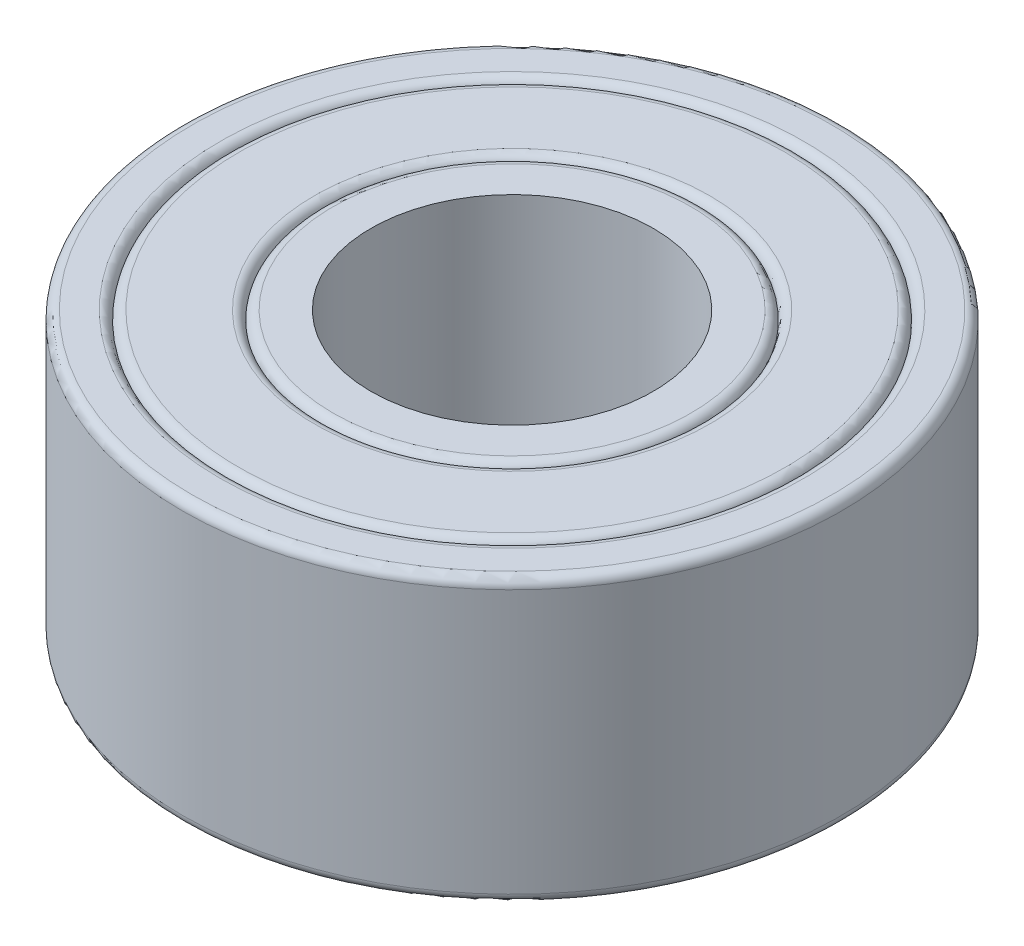
ISO-10303-21;
HEADER;
FILE_DESCRIPTION(('STEP AP214'),'2;1');
FILE_NAME('part.step','',(''),(''),'','','');
FILE_SCHEMA(('AUTOMOTIVE_DESIGN { 1 0 10303 214 1 1 1 1 }'));
ENDSEC;
DATA;
#1=APPLICATION_CONTEXT('core data for automotive mechanical design processes');
#2=APPLICATION_PROTOCOL_DEFINITION('international standard','automotive_design',2000,#1);
#3=PRODUCT_CONTEXT('',#1,'mechanical');
#4=PRODUCT('Part','Part','',(#3));
#5=PRODUCT_RELATED_PRODUCT_CATEGORY('part','',(#4));
#6=PRODUCT_DEFINITION_FORMATION('','',#4);
#7=PRODUCT_DEFINITION_CONTEXT('part definition',#1,'design');
#8=PRODUCT_DEFINITION('design','',#6,#7);
#9=PRODUCT_DEFINITION_SHAPE('','',#8);
#10=(LENGTH_UNIT() NAMED_UNIT(*) SI_UNIT(.MILLI.,.METRE.));
#11=(NAMED_UNIT(*) PLANE_ANGLE_UNIT() SI_UNIT($,.RADIAN.));
#12=(NAMED_UNIT(*) SI_UNIT($,.STERADIAN.) SOLID_ANGLE_UNIT());
#13=UNCERTAINTY_MEASURE_WITH_UNIT(LENGTH_MEASURE(1.E-05),#10,'distance_accuracy_value','');
#14=(GEOMETRIC_REPRESENTATION_CONTEXT(3) GLOBAL_UNCERTAINTY_ASSIGNED_CONTEXT((#13)) GLOBAL_UNIT_ASSIGNED_CONTEXT((#10,
#11,#12)) REPRESENTATION_CONTEXT('',''));
#15=CARTESIAN_POINT('',(0.,0.,0.));
#16=DIRECTION('',(0.,0.,1.));
#17=DIRECTION('',(1.,0.,0.));
#18=AXIS2_PLACEMENT_3D('',#15,#16,#17);
#19=CARTESIAN_POINT('',(0.,3.,0.));
#20=DIRECTION('',(0.,1.,0.));
#21=DIRECTION('',(0.,0.,1.));
#22=AXIS2_PLACEMENT_3D('',#19,#20,#21);
#23=PLANE('',#22);
#24=CARTESIAN_POINT('',(0.,3.,0.));
#25=DIRECTION('',(0.,1.,0.));
#26=DIRECTION('',(0.,0.,1.));
#27=AXIS2_PLACEMENT_3D('',#24,#25,#26);
#28=CIRCLE('',#27,1.9);
#29=CARTESIAN_POINT('',(0.,3.,1.9));
#30=VERTEX_POINT('',#29);
#31=EDGE_CURVE('E105',#30,#30,#28,.T.);
#32=ORIENTED_EDGE('',*,*,#31,.T.);
#33=EDGE_LOOP('',(#32));
#34=FACE_BOUND('',#33,.T.);
#35=CARTESIAN_POINT('',(0.,3.,0.));
#36=DIRECTION('',(0.,1.,0.));
#37=DIRECTION('',(0.,0.,1.));
#38=AXIS2_PLACEMENT_3D('',#35,#36,#37);
#39=CIRCLE('',#38,1.5);
#40=CARTESIAN_POINT('',(0.,3.,1.5));
#41=VERTEX_POINT('',#40);
#42=EDGE_CURVE('E109',#41,#41,#39,.T.);
#43=ORIENTED_EDGE('',*,*,#42,.F.);
#44=EDGE_LOOP('',(#43));
#45=FACE_BOUND('',#44,.T.);
#46=ADVANCED_FACE('F37',(#34,#45),#23,.T.);
#47=CARTESIAN_POINT('',(0.,0.,0.));
#48=DIRECTION('',(0.,1.,0.));
#49=DIRECTION('',(0.,0.,1.));
#50=AXIS2_PLACEMENT_3D('',#47,#48,#49);
#51=PLANE('',#50);
#52=CARTESIAN_POINT('',(0.,0.,0.));
#53=DIRECTION('',(0.,1.,0.));
#54=DIRECTION('',(0.,0.,1.));
#55=AXIS2_PLACEMENT_3D('',#52,#53,#54);
#56=CIRCLE('',#55,1.9);
#57=CARTESIAN_POINT('',(0.,0.,1.9));
#58=VERTEX_POINT('',#57);
#59=EDGE_CURVE('E93',#58,#58,#56,.F.);
#60=ORIENTED_EDGE('',*,*,#59,.T.);
#61=EDGE_LOOP('',(#60));
#62=FACE_BOUND('',#61,.T.);
#63=CARTESIAN_POINT('',(0.,0.,0.));
#64=DIRECTION('',(0.,1.,0.));
#65=DIRECTION('',(0.,0.,1.));
#66=AXIS2_PLACEMENT_3D('',#63,#64,#65);
#67=CIRCLE('',#66,1.5);
#68=CARTESIAN_POINT('',(0.,0.,1.5));
#69=VERTEX_POINT('',#68);
#70=EDGE_CURVE('E110',#69,#69,#67,.T.);
#71=ORIENTED_EDGE('',*,*,#70,.T.);
#72=EDGE_LOOP('',(#71));
#73=FACE_BOUND('',#72,.T.);
#74=ADVANCED_FACE('F122',(#62,#73),#51,.F.);
#75=CARTESIAN_POINT('',(0.,3.,0.));
#76=DIRECTION('',(0.,-1.,0.));
#77=DIRECTION('',(0.,0.,-1.));
#78=AXIS2_PLACEMENT_3D('',#75,#76,#77);
#79=CYLINDRICAL_SURFACE('',#78,1.5);
#80=ORIENTED_EDGE('',*,*,#42,.T.);
#81=EDGE_LOOP('',(#80));
#82=FACE_BOUND('',#81,.T.);
#83=ORIENTED_EDGE('',*,*,#70,.F.);
#84=EDGE_LOOP('',(#83));
#85=FACE_BOUND('',#84,.T.);
#86=ADVANCED_FACE('F118',(#82,#85),#79,.F.);
#87=CARTESIAN_POINT('',(0.,2.9,0.));
#88=DIRECTION('',(0.,1.,0.));
#89=DIRECTION('',(0.,0.,1.));
#90=AXIS2_PLACEMENT_3D('',#87,#88,#89);
#91=TOROIDAL_SURFACE('',#90,1.9,0.1);
#92=CARTESIAN_POINT('',(0.,2.9,0.));
#93=DIRECTION('',(0.,1.,0.));
#94=DIRECTION('',(0.,0.,1.));
#95=AXIS2_PLACEMENT_3D('',#92,#93,#94);
#96=CIRCLE('',#95,2.);
#97=CARTESIAN_POINT('',(0.,2.9,2.));
#98=VERTEX_POINT('',#97);
#99=EDGE_CURVE('E97',#98,#98,#96,.F.);
#100=ORIENTED_EDGE('',*,*,#99,.F.);
#101=EDGE_LOOP('',(#100));
#102=FACE_BOUND('',#101,.T.);
#103=ORIENTED_EDGE('',*,*,#31,.F.);
#104=EDGE_LOOP('',(#103));
#105=FACE_BOUND('',#104,.T.);
#106=ADVANCED_FACE('F133',(#102,#105),#91,.T.);
#107=CARTESIAN_POINT('',(0.,0.0999999999999998,0.));
#108=DIRECTION('',(0.,1.,0.));
#109=DIRECTION('',(0.,0.,1.));
#110=AXIS2_PLACEMENT_3D('',#107,#108,#109);
#111=TOROIDAL_SURFACE('',#110,1.9,0.1);
#112=ORIENTED_EDGE('',*,*,#59,.F.);
#113=EDGE_LOOP('',(#112));
#114=FACE_BOUND('',#113,.T.);
#115=CARTESIAN_POINT('',(0.,0.0999999999999998,0.));
#116=DIRECTION('',(0.,1.,0.));
#117=DIRECTION('',(0.,0.,1.));
#118=AXIS2_PLACEMENT_3D('',#115,#116,#117);
#119=CIRCLE('',#118,2.);
#120=CARTESIAN_POINT('',(0.,0.0999999999999998,2.));
#121=VERTEX_POINT('',#120);
#122=EDGE_CURVE('E101',#121,#121,#119,.T.);
#123=ORIENTED_EDGE('',*,*,#122,.F.);
#124=EDGE_LOOP('',(#123));
#125=FACE_BOUND('',#124,.T.);
#126=ADVANCED_FACE('F136',(#114,#125),#111,.T.);
#127=CARTESIAN_POINT('',(0.,3.,0.));
#128=DIRECTION('',(0.,-1.,0.));
#129=DIRECTION('',(0.,0.,-1.));
#130=AXIS2_PLACEMENT_3D('',#127,#128,#129);
#131=PLANE('',#130);
#132=CARTESIAN_POINT('',(0.,3.,0.));
#133=DIRECTION('',(0.,-1.,0.));
#134=DIRECTION('',(0.,0.,-1.));
#135=AXIS2_PLACEMENT_3D('',#132,#133,#134);
#136=CIRCLE('',#135,2.1);
#137=CARTESIAN_POINT('',(0.,3.,-2.1));
#138=VERTEX_POINT('',#137);
#139=EDGE_CURVE('E73',#138,#138,#136,.T.);
#140=ORIENTED_EDGE('',*,*,#139,.T.);
#141=EDGE_LOOP('',(#140));
#142=FACE_BOUND('',#141,.T.);
#143=CARTESIAN_POINT('',(0.,3.,0.));
#144=DIRECTION('',(0.,-1.,0.));
#145=DIRECTION('',(0.,0.,-1.));
#146=AXIS2_PLACEMENT_3D('',#143,#144,#145);
#147=CIRCLE('',#146,2.9);
#148=CARTESIAN_POINT('',(0.,3.,-2.9));
#149=VERTEX_POINT('',#148);
#150=EDGE_CURVE('E77',#149,#149,#147,.F.);
#151=ORIENTED_EDGE('',*,*,#150,.T.);
#152=EDGE_LOOP('',(#151));
#153=FACE_BOUND('',#152,.T.);
#154=ADVANCED_FACE('F140',(#142,#153),#131,.F.);
#155=CARTESIAN_POINT('',(0.,0.,0.));
#156=DIRECTION('',(0.,-1.,0.));
#157=DIRECTION('',(0.,0.,-1.));
#158=AXIS2_PLACEMENT_3D('',#155,#156,#157);
#159=PLANE('',#158);
#160=CARTESIAN_POINT('',(0.,0.,0.));
#161=DIRECTION('',(0.,-1.,0.));
#162=DIRECTION('',(0.,0.,-1.));
#163=AXIS2_PLACEMENT_3D('',#160,#161,#162);
#164=CIRCLE('',#163,2.9);
#165=CARTESIAN_POINT('',(0.,0.,-2.9));
#166=VERTEX_POINT('',#165);
#167=EDGE_CURVE('E85',#166,#166,#164,.T.);
#168=ORIENTED_EDGE('',*,*,#167,.T.);
#169=EDGE_LOOP('',(#168));
#170=FACE_BOUND('',#169,.T.);
#171=CARTESIAN_POINT('',(0.,0.,0.));
#172=DIRECTION('',(0.,-1.,0.));
#173=DIRECTION('',(0.,0.,-1.));
#174=AXIS2_PLACEMENT_3D('',#171,#172,#173);
#175=CIRCLE('',#174,2.1);
#176=CARTESIAN_POINT('',(0.,0.,-2.1));
#177=VERTEX_POINT('',#176);
#178=EDGE_CURVE('E89',#177,#177,#175,.F.);
#179=ORIENTED_EDGE('',*,*,#178,.T.);
#180=EDGE_LOOP('',(#179));
#181=FACE_BOUND('',#180,.T.);
#182=ADVANCED_FACE('F146',(#170,#181),#159,.T.);
#183=CARTESIAN_POINT('',(0.,0.0999999999999998,0.));
#184=DIRECTION('',(0.,-1.,0.));
#185=DIRECTION('',(0.,0.,-1.));
#186=AXIS2_PLACEMENT_3D('',#183,#184,#185);
#187=TOROIDAL_SURFACE('',#186,2.9,0.1);
#188=CARTESIAN_POINT('',(0.,0.0999999999999998,0.));
#189=DIRECTION('',(0.,-1.,0.));
#190=DIRECTION('',(0.,0.,-1.));
#191=AXIS2_PLACEMENT_3D('',#188,#189,#190);
#192=CIRCLE('',#191,3.);
#193=CARTESIAN_POINT('',(0.,0.0999999999999998,-3.));
#194=VERTEX_POINT('',#193);
#195=EDGE_CURVE('E81',#194,#194,#192,.F.);
#196=ORIENTED_EDGE('',*,*,#195,.F.);
#197=EDGE_LOOP('',(#196));
#198=FACE_BOUND('',#197,.T.);
#199=ORIENTED_EDGE('',*,*,#167,.F.);
#200=EDGE_LOOP('',(#199));
#201=FACE_BOUND('',#200,.T.);
#202=ADVANCED_FACE('F142',(#198,#201),#187,.T.);
#203=CARTESIAN_POINT('',(0.,0.0999999999999998,0.));
#204=DIRECTION('',(0.,-1.,0.));
#205=DIRECTION('',(0.,0.,-1.));
#206=AXIS2_PLACEMENT_3D('',#203,#204,#205);
#207=TOROIDAL_SURFACE('',#206,2.1,0.1);
#208=ORIENTED_EDGE('',*,*,#178,.F.);
#209=EDGE_LOOP('',(#208));
#210=FACE_BOUND('',#209,.T.);
#211=ORIENTED_EDGE('',*,*,#122,.T.);
#212=EDGE_LOOP('',(#211));
#213=FACE_BOUND('',#212,.T.);
#214=ADVANCED_FACE('F145',(#210,#213),#207,.T.);
#215=CARTESIAN_POINT('',(0.,2.9,0.));
#216=DIRECTION('',(0.,-1.,0.));
#217=DIRECTION('',(0.,0.,-1.));
#218=AXIS2_PLACEMENT_3D('',#215,#216,#217);
#219=TOROIDAL_SURFACE('',#218,2.1,0.1);
#220=ORIENTED_EDGE('',*,*,#99,.T.);
#221=EDGE_LOOP('',(#220));
#222=FACE_BOUND('',#221,.T.);
#223=ORIENTED_EDGE('',*,*,#139,.F.);
#224=EDGE_LOOP('',(#223));
#225=FACE_BOUND('',#224,.T.);
#226=ADVANCED_FACE('F150',(#222,#225),#219,.T.);
#227=CARTESIAN_POINT('',(0.,2.9,0.));
#228=DIRECTION('',(0.,-1.,0.));
#229=DIRECTION('',(0.,0.,-1.));
#230=AXIS2_PLACEMENT_3D('',#227,#228,#229);
#231=TOROIDAL_SURFACE('',#230,2.9,0.1);
#232=ORIENTED_EDGE('',*,*,#150,.F.);
#233=EDGE_LOOP('',(#232));
#234=FACE_BOUND('',#233,.T.);
#235=CARTESIAN_POINT('',(0.,2.9,0.));
#236=DIRECTION('',(0.,-1.,0.));
#237=DIRECTION('',(0.,0.,-1.));
#238=AXIS2_PLACEMENT_3D('',#235,#236,#237);
#239=CIRCLE('',#238,3.);
#240=CARTESIAN_POINT('',(0.,2.9,-3.));
#241=VERTEX_POINT('',#240);
#242=EDGE_CURVE('E69',#241,#241,#239,.T.);
#243=ORIENTED_EDGE('',*,*,#242,.F.);
#244=EDGE_LOOP('',(#243));
#245=FACE_BOUND('',#244,.T.);
#246=ADVANCED_FACE('F154',(#234,#245),#231,.T.);
#247=CARTESIAN_POINT('',(0.,0.,0.));
#248=DIRECTION('',(0.,1.,0.));
#249=DIRECTION('',(0.,0.,1.));
#250=AXIS2_PLACEMENT_3D('',#247,#248,#249);
#251=CYLINDRICAL_SURFACE('',#250,3.5);
#252=CARTESIAN_POINT('',(0.,2.9,0.));
#253=DIRECTION('',(0.,1.,0.));
#254=DIRECTION('',(0.,0.,1.));
#255=AXIS2_PLACEMENT_3D('',#252,#253,#254);
#256=CIRCLE('',#255,3.5);
#257=CARTESIAN_POINT('',(0.,2.9,3.5));
#258=VERTEX_POINT('',#257);
#259=EDGE_CURVE('E50',#258,#258,#256,.F.);
#260=ORIENTED_EDGE('',*,*,#259,.T.);
#261=EDGE_LOOP('',(#260));
#262=FACE_BOUND('',#261,.T.);
#263=CARTESIAN_POINT('',(0.,0.1,0.));
#264=DIRECTION('',(0.,1.,0.));
#265=DIRECTION('',(0.,0.,1.));
#266=AXIS2_PLACEMENT_3D('',#263,#264,#265);
#267=CIRCLE('',#266,3.5);
#268=CARTESIAN_POINT('',(0.,0.1,3.5));
#269=VERTEX_POINT('',#268);
#270=EDGE_CURVE('E55',#269,#269,#267,.T.);
#271=ORIENTED_EDGE('',*,*,#270,.T.);
#272=EDGE_LOOP('',(#271));
#273=FACE_BOUND('',#272,.T.);
#274=ADVANCED_FACE('F158',(#262,#273),#251,.T.);
#275=CARTESIAN_POINT('',(0.,0.,0.));
#276=DIRECTION('',(0.,1.,0.));
#277=DIRECTION('',(0.,0.,1.));
#278=AXIS2_PLACEMENT_3D('',#275,#276,#277);
#279=PLANE('',#278);
#280=CARTESIAN_POINT('',(0.,0.,0.));
#281=DIRECTION('',(0.,1.,0.));
#282=DIRECTION('',(0.,0.,1.));
#283=AXIS2_PLACEMENT_3D('',#280,#281,#282);
#284=CIRCLE('',#283,3.4);
#285=CARTESIAN_POINT('',(0.,0.,3.4));
#286=VERTEX_POINT('',#285);
#287=EDGE_CURVE('E10',#286,#286,#284,.F.);
#288=ORIENTED_EDGE('',*,*,#287,.T.);
#289=EDGE_LOOP('',(#288));
#290=FACE_BOUND('',#289,.T.);
#291=CARTESIAN_POINT('',(0.,0.,0.));
#292=DIRECTION('',(0.,1.,0.));
#293=DIRECTION('',(0.,0.,1.));
#294=AXIS2_PLACEMENT_3D('',#291,#292,#293);
#295=CIRCLE('',#294,3.1);
#296=CARTESIAN_POINT('',(0.,0.,3.1));
#297=VERTEX_POINT('',#296);
#298=EDGE_CURVE('E45',#297,#297,#295,.T.);
#299=ORIENTED_EDGE('',*,*,#298,.T.);
#300=EDGE_LOOP('',(#299));
#301=FACE_BOUND('',#300,.T.);
#302=ADVANCED_FACE('F194',(#290,#301),#279,.F.);
#303=CARTESIAN_POINT('',(0.,3.,0.));
#304=DIRECTION('',(0.,1.,0.));
#305=DIRECTION('',(0.,0.,1.));
#306=AXIS2_PLACEMENT_3D('',#303,#304,#305);
#307=PLANE('',#306);
#308=CARTESIAN_POINT('',(0.,3.,0.));
#309=DIRECTION('',(0.,1.,0.));
#310=DIRECTION('',(0.,0.,1.));
#311=AXIS2_PLACEMENT_3D('',#308,#309,#310);
#312=CIRCLE('',#311,3.4);
#313=CARTESIAN_POINT('',(0.,3.,3.4));
#314=VERTEX_POINT('',#313);
#315=EDGE_CURVE('E61',#314,#314,#312,.T.);
#316=ORIENTED_EDGE('',*,*,#315,.T.);
#317=EDGE_LOOP('',(#316));
#318=FACE_BOUND('',#317,.T.);
#319=CARTESIAN_POINT('',(0.,3.,0.));
#320=DIRECTION('',(0.,1.,0.));
#321=DIRECTION('',(0.,0.,1.));
#322=AXIS2_PLACEMENT_3D('',#319,#320,#321);
#323=CIRCLE('',#322,3.1);
#324=CARTESIAN_POINT('',(0.,3.,3.1));
#325=VERTEX_POINT('',#324);
#326=EDGE_CURVE('E65',#325,#325,#323,.F.);
#327=ORIENTED_EDGE('',*,*,#326,.T.);
#328=EDGE_LOOP('',(#327));
#329=FACE_BOUND('',#328,.T.);
#330=ADVANCED_FACE('F164',(#318,#329),#307,.T.);
#331=CARTESIAN_POINT('',(0.,2.9,0.));
#332=DIRECTION('',(0.,1.,0.));
#333=DIRECTION('',(0.,0.,1.));
#334=AXIS2_PLACEMENT_3D('',#331,#332,#333);
#335=TOROIDAL_SURFACE('',#334,3.4,0.1);
#336=ORIENTED_EDGE('',*,*,#259,.F.);
#337=EDGE_LOOP('',(#336));
#338=FACE_BOUND('',#337,.T.);
#339=ORIENTED_EDGE('',*,*,#315,.F.);
#340=EDGE_LOOP('',(#339));
#341=FACE_BOUND('',#340,.T.);
#342=ADVANCED_FACE('F160',(#338,#341),#335,.T.);
#343=CARTESIAN_POINT('',(0.,0.1,0.));
#344=DIRECTION('',(0.,1.,0.));
#345=DIRECTION('',(0.,0.,1.));
#346=AXIS2_PLACEMENT_3D('',#343,#344,#345);
#347=TOROIDAL_SURFACE('',#346,3.4,0.1);
#348=ORIENTED_EDGE('',*,*,#287,.F.);
#349=EDGE_LOOP('',(#348));
#350=FACE_BOUND('',#349,.T.);
#351=ORIENTED_EDGE('',*,*,#270,.F.);
#352=EDGE_LOOP('',(#351));
#353=FACE_BOUND('',#352,.T.);
#354=ADVANCED_FACE('F163',(#350,#353),#347,.T.);
#355=CARTESIAN_POINT('',(0.,0.1,0.));
#356=DIRECTION('',(0.,1.,0.));
#357=DIRECTION('',(0.,0.,1.));
#358=AXIS2_PLACEMENT_3D('',#355,#356,#357);
#359=TOROIDAL_SURFACE('',#358,3.1,0.1);
#360=ORIENTED_EDGE('',*,*,#195,.T.);
#361=EDGE_LOOP('',(#360));
#362=FACE_BOUND('',#361,.T.);
#363=ORIENTED_EDGE('',*,*,#298,.F.);
#364=EDGE_LOOP('',(#363));
#365=FACE_BOUND('',#364,.T.);
#366=ADVANCED_FACE('F167',(#362,#365),#359,.T.);
#367=CARTESIAN_POINT('',(0.,2.9,0.));
#368=DIRECTION('',(0.,1.,0.));
#369=DIRECTION('',(0.,0.,1.));
#370=AXIS2_PLACEMENT_3D('',#367,#368,#369);
#371=TOROIDAL_SURFACE('',#370,3.1,0.1);
#372=ORIENTED_EDGE('',*,*,#326,.F.);
#373=EDGE_LOOP('',(#372));
#374=FACE_BOUND('',#373,.T.);
#375=ORIENTED_EDGE('',*,*,#242,.T.);
#376=EDGE_LOOP('',(#375));
#377=FACE_BOUND('',#376,.T.);
#378=ADVANCED_FACE('F39',(#374,#377),#371,.T.);
#379=CLOSED_SHELL('',(#46,#74,#86,#106,#126,#154,#182,#202,#214,#226,#246,#274,#302,#330,#342,
#354,#366,#378));
#380=MANIFOLD_SOLID_BREP('B2',#379);
#381=ADVANCED_BREP_SHAPE_REPRESENTATION('',(#18,#380),#14);
#382=SHAPE_DEFINITION_REPRESENTATION(#9,#381);
ENDSEC;
END-ISO-10303-21;
